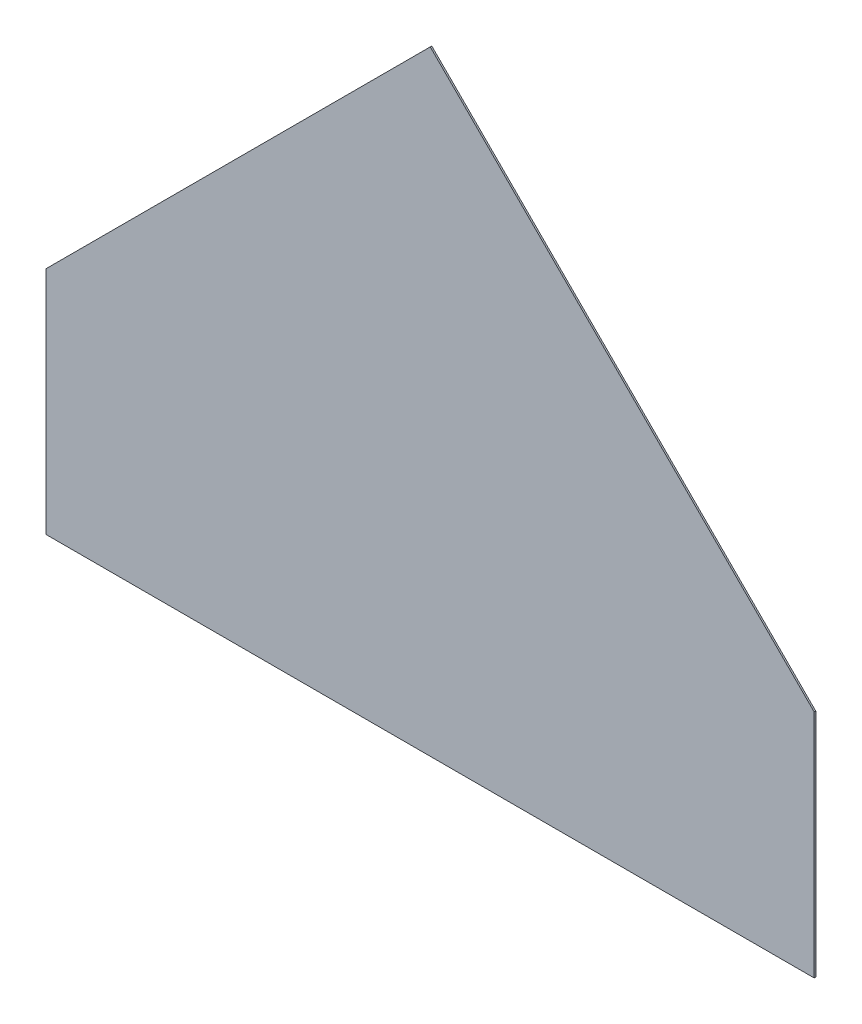
ISO-10303-21;
HEADER;
FILE_DESCRIPTION(('STEP AP214'),'2;1');
FILE_NAME('part.step','',(''),(''),'','','');
FILE_SCHEMA(('AUTOMOTIVE_DESIGN { 1 0 10303 214 1 1 1 1 }'));
ENDSEC;
DATA;
#1=APPLICATION_CONTEXT('core data for automotive mechanical design processes');
#2=APPLICATION_PROTOCOL_DEFINITION('international standard','automotive_design',2000,#1);
#3=PRODUCT_CONTEXT('',#1,'mechanical');
#4=PRODUCT('Part','Part','',(#3));
#5=PRODUCT_RELATED_PRODUCT_CATEGORY('part','',(#4));
#6=PRODUCT_DEFINITION_FORMATION('','',#4);
#7=PRODUCT_DEFINITION_CONTEXT('part definition',#1,'design');
#8=PRODUCT_DEFINITION('design','',#6,#7);
#9=PRODUCT_DEFINITION_SHAPE('','',#8);
#10=(LENGTH_UNIT() NAMED_UNIT(*) SI_UNIT(.MILLI.,.METRE.));
#11=(NAMED_UNIT(*) PLANE_ANGLE_UNIT() SI_UNIT($,.RADIAN.));
#12=(NAMED_UNIT(*) SI_UNIT($,.STERADIAN.) SOLID_ANGLE_UNIT());
#13=UNCERTAINTY_MEASURE_WITH_UNIT(LENGTH_MEASURE(1.E-05),#10,'distance_accuracy_value','');
#14=(GEOMETRIC_REPRESENTATION_CONTEXT(3) GLOBAL_UNCERTAINTY_ASSIGNED_CONTEXT((#13)) GLOBAL_UNIT_ASSIGNED_CONTEXT((#10,
#11,#12)) REPRESENTATION_CONTEXT('',''));
#15=CARTESIAN_POINT('',(0.,0.,0.));
#16=DIRECTION('',(0.,0.,1.));
#17=DIRECTION('',(1.,0.,0.));
#18=AXIS2_PLACEMENT_3D('',#15,#16,#17);
#19=CARTESIAN_POINT('',(25.,0.,0.1));
#20=DIRECTION('',(-1.,0.,0.));
#21=DIRECTION('',(0.,-1.,0.));
#22=AXIS2_PLACEMENT_3D('',#19,#20,#21);
#23=PLANE('',#22);
#24=DIRECTION('',(0.,1.,0.));
#25=VECTOR('',#24,1.);
#26=CARTESIAN_POINT('',(25.,0.,0.));
#27=LINE('',#26,#25);
#28=CARTESIAN_POINT('',(25.,0.,0.));
#29=VERTEX_POINT('',#28);
#30=CARTESIAN_POINT('',(24.9999999999997,14.9999999999997,0.));
#31=VERTEX_POINT('',#30);
#32=EDGE_CURVE('E122',#29,#31,#27,.T.);
#33=ORIENTED_EDGE('',*,*,#32,.T.);
#34=DIRECTION('',(0.,0.,-1.));
#35=VECTOR('',#34,1.);
#36=CARTESIAN_POINT('',(24.9999999999997,14.9999999999997,0.1));
#37=LINE('',#36,#35);
#38=CARTESIAN_POINT('',(24.9999999999997,14.9999999999997,0.1));
#39=VERTEX_POINT('',#38);
#40=EDGE_CURVE('E48',#39,#31,#37,.T.);
#41=ORIENTED_EDGE('',*,*,#40,.F.);
#42=DIRECTION('',(0.,1.,0.));
#43=VECTOR('',#42,1.);
#44=CARTESIAN_POINT('',(25.,0.,0.1));
#45=LINE('',#44,#43);
#46=CARTESIAN_POINT('',(25.,0.,0.1));
#47=VERTEX_POINT('',#46);
#48=EDGE_CURVE('E90',#47,#39,#45,.T.);
#49=ORIENTED_EDGE('',*,*,#48,.F.);
#50=DIRECTION('',(0.,0.,-1.));
#51=VECTOR('',#50,1.);
#52=CARTESIAN_POINT('',(25.,0.,0.1));
#53=LINE('',#52,#51);
#54=EDGE_CURVE('E11',#47,#29,#53,.T.);
#55=ORIENTED_EDGE('',*,*,#54,.T.);
#56=EDGE_LOOP('',(#33,#41,#49,#55));
#57=FACE_BOUND('',#56,.T.);
#58=ADVANCED_FACE('F39',(#57),#23,.F.);
#59=CARTESIAN_POINT('',(24.9999999999997,14.9999999999997,0.1));
#60=DIRECTION('',(-0.707106781186551,-0.707106781186544,0.));
#61=DIRECTION('',(0.707106781186544,-0.707106781186551,0.));
#62=AXIS2_PLACEMENT_3D('',#59,#60,#61);
#63=PLANE('',#62);
#64=DIRECTION('',(-0.707106781186544,0.707106781186551,0.));
#65=VECTOR('',#64,1.);
#66=CARTESIAN_POINT('',(24.9999999999997,14.9999999999997,0.));
#67=LINE('',#66,#65);
#68=CARTESIAN_POINT('',(0.,39.9999999999997,0.));
#69=VERTEX_POINT('',#68);
#70=EDGE_CURVE('E108',#31,#69,#67,.T.);
#71=ORIENTED_EDGE('',*,*,#70,.T.);
#72=DIRECTION('',(0.,0.,-1.));
#73=VECTOR('',#72,1.);
#74=CARTESIAN_POINT('',(0.,39.9999999999997,0.1));
#75=LINE('',#74,#73);
#76=CARTESIAN_POINT('',(0.,39.9999999999997,0.1));
#77=VERTEX_POINT('',#76);
#78=EDGE_CURVE('E105',#77,#69,#75,.T.);
#79=ORIENTED_EDGE('',*,*,#78,.F.);
#80=DIRECTION('',(-0.707106781186544,0.707106781186551,0.));
#81=VECTOR('',#80,1.);
#82=CARTESIAN_POINT('',(24.9999999999997,14.9999999999997,0.1));
#83=LINE('',#82,#81);
#84=EDGE_CURVE('E95',#39,#77,#83,.T.);
#85=ORIENTED_EDGE('',*,*,#84,.F.);
#86=ORIENTED_EDGE('',*,*,#40,.T.);
#87=EDGE_LOOP('',(#71,#79,#85,#86));
#88=FACE_BOUND('',#87,.T.);
#89=ADVANCED_FACE('F106',(#88),#63,.F.);
#90=CARTESIAN_POINT('',(-25.,15.,0.1));
#91=DIRECTION('',(0.707106781186544,-0.707106781186551,0.));
#92=DIRECTION('',(0.707106781186551,0.707106781186544,0.));
#93=AXIS2_PLACEMENT_3D('',#90,#91,#92);
#94=PLANE('',#93);
#95=DIRECTION('',(-0.707106781186551,-0.707106781186544,0.));
#96=VECTOR('',#95,1.);
#97=CARTESIAN_POINT('',(-25.,15.,0.));
#98=LINE('',#97,#96);
#99=CARTESIAN_POINT('',(-25.,15.,0.));
#100=VERTEX_POINT('',#99);
#101=EDGE_CURVE('E76',#69,#100,#98,.T.);
#102=ORIENTED_EDGE('',*,*,#101,.T.);
#103=DIRECTION('',(0.,0.,-1.));
#104=VECTOR('',#103,1.);
#105=CARTESIAN_POINT('',(-25.,15.,0.1));
#106=LINE('',#105,#104);
#107=CARTESIAN_POINT('',(-25.,15.,0.1));
#108=VERTEX_POINT('',#107);
#109=EDGE_CURVE('E110',#108,#100,#106,.T.);
#110=ORIENTED_EDGE('',*,*,#109,.F.);
#111=DIRECTION('',(-0.707106781186551,-0.707106781186544,0.));
#112=VECTOR('',#111,1.);
#113=CARTESIAN_POINT('',(-3.78679656440345,36.2132034355963,0.1));
#114=LINE('',#113,#112);
#115=EDGE_CURVE('E99',#77,#108,#114,.T.);
#116=ORIENTED_EDGE('',*,*,#115,.F.);
#117=ORIENTED_EDGE('',*,*,#78,.T.);
#118=EDGE_LOOP('',(#102,#110,#116,#117));
#119=FACE_BOUND('',#118,.T.);
#120=ADVANCED_FACE('F112',(#119),#94,.F.);
#121=CARTESIAN_POINT('',(-25.,0.,0.1));
#122=DIRECTION('',(1.,0.,0.));
#123=DIRECTION('',(0.,0.,-1.));
#124=AXIS2_PLACEMENT_3D('',#121,#122,#123);
#125=PLANE('',#124);
#126=DIRECTION('',(0.,-1.,0.));
#127=VECTOR('',#126,1.);
#128=CARTESIAN_POINT('',(-25.,0.,0.));
#129=LINE('',#128,#127);
#130=CARTESIAN_POINT('',(-25.,0.,0.));
#131=VERTEX_POINT('',#130);
#132=EDGE_CURVE('E83',#100,#131,#129,.T.);
#133=ORIENTED_EDGE('',*,*,#132,.T.);
#134=DIRECTION('',(0.,0.,-1.));
#135=VECTOR('',#134,1.);
#136=CARTESIAN_POINT('',(-25.,0.,0.1));
#137=LINE('',#136,#135);
#138=CARTESIAN_POINT('',(-25.,0.,0.1));
#139=VERTEX_POINT('',#138);
#140=EDGE_CURVE('E118',#139,#131,#137,.T.);
#141=ORIENTED_EDGE('',*,*,#140,.F.);
#142=DIRECTION('',(0.,-1.,0.));
#143=VECTOR('',#142,1.);
#144=CARTESIAN_POINT('',(-25.,0.,0.1));
#145=LINE('',#144,#143);
#146=EDGE_CURVE('E115',#108,#139,#145,.T.);
#147=ORIENTED_EDGE('',*,*,#146,.F.);
#148=ORIENTED_EDGE('',*,*,#109,.T.);
#149=EDGE_LOOP('',(#133,#141,#147,#148));
#150=FACE_BOUND('',#149,.T.);
#151=ADVANCED_FACE('F143',(#150),#125,.F.);
#152=CARTESIAN_POINT('',(0.,0.,0.1));
#153=DIRECTION('',(0.,1.,0.));
#154=DIRECTION('',(-1.,0.,0.));
#155=AXIS2_PLACEMENT_3D('',#152,#153,#154);
#156=PLANE('',#155);
#157=DIRECTION('',(1.,0.,0.));
#158=VECTOR('',#157,1.);
#159=CARTESIAN_POINT('',(0.,0.,0.));
#160=LINE('',#159,#158);
#161=EDGE_CURVE('E131',#131,#29,#160,.T.);
#162=ORIENTED_EDGE('',*,*,#161,.T.);
#163=ORIENTED_EDGE('',*,*,#54,.F.);
#164=DIRECTION('',(1.,0.,0.));
#165=VECTOR('',#164,1.);
#166=CARTESIAN_POINT('',(0.,0.,0.1));
#167=LINE('',#166,#165);
#168=EDGE_CURVE('E56',#139,#47,#167,.T.);
#169=ORIENTED_EDGE('',*,*,#168,.F.);
#170=ORIENTED_EDGE('',*,*,#140,.T.);
#171=EDGE_LOOP('',(#162,#163,#169,#170));
#172=FACE_BOUND('',#171,.T.);
#173=ADVANCED_FACE('F142',(#172),#156,.F.);
#174=CARTESIAN_POINT('',(0.,0.,0.1));
#175=DIRECTION('',(0.,0.,1.));
#176=DIRECTION('',(1.,0.,0.));
#177=AXIS2_PLACEMENT_3D('',#174,#175,#176);
#178=PLANE('',#177);
#179=ORIENTED_EDGE('',*,*,#168,.T.);
#180=ORIENTED_EDGE('',*,*,#48,.T.);
#181=ORIENTED_EDGE('',*,*,#84,.T.);
#182=ORIENTED_EDGE('',*,*,#115,.T.);
#183=ORIENTED_EDGE('',*,*,#146,.T.);
#184=EDGE_LOOP('',(#179,#180,#181,#182,#183));
#185=FACE_BOUND('',#184,.T.);
#186=ADVANCED_FACE('F97',(#185),#178,.T.);
#187=CARTESIAN_POINT('',(0.,0.,0.));
#188=DIRECTION('',(0.,0.,1.));
#189=DIRECTION('',(1.,0.,0.));
#190=AXIS2_PLACEMENT_3D('',#187,#188,#189);
#191=PLANE('',#190);
#192=ORIENTED_EDGE('',*,*,#32,.F.);
#193=ORIENTED_EDGE('',*,*,#161,.F.);
#194=ORIENTED_EDGE('',*,*,#132,.F.);
#195=ORIENTED_EDGE('',*,*,#101,.F.);
#196=ORIENTED_EDGE('',*,*,#70,.F.);
#197=EDGE_LOOP('',(#192,#193,#194,#195,#196));
#198=FACE_BOUND('',#197,.T.);
#199=ADVANCED_FACE('F140',(#198),#191,.F.);
#200=CLOSED_SHELL('',(#58,#89,#120,#151,#173,#186,#199));
#201=MANIFOLD_SOLID_BREP('B2',#200);
#202=ADVANCED_BREP_SHAPE_REPRESENTATION('',(#18,#201),#14);
#203=SHAPE_DEFINITION_REPRESENTATION(#9,#202);
ENDSEC;
END-ISO-10303-21;
